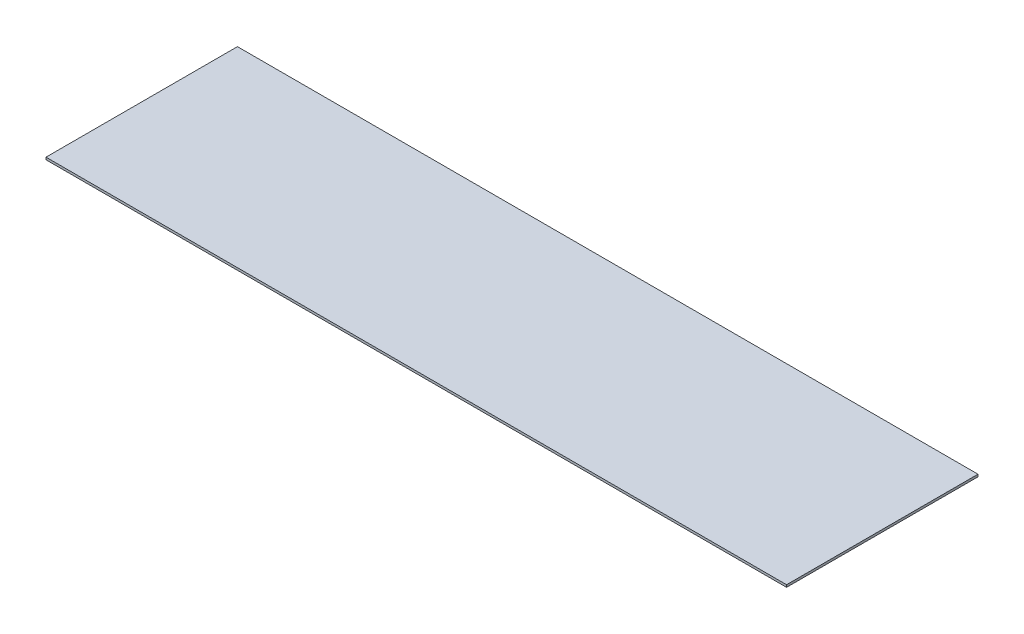
ISO-10303-21;
HEADER;
FILE_DESCRIPTION(('STEP AP214'),'2;1');
FILE_NAME('part.step','',(''),(''),'','','');
FILE_SCHEMA(('AUTOMOTIVE_DESIGN { 1 0 10303 214 1 1 1 1 }'));
ENDSEC;
DATA;
#1=APPLICATION_CONTEXT('core data for automotive mechanical design processes');
#2=APPLICATION_PROTOCOL_DEFINITION('international standard','automotive_design',2000,#1);
#3=PRODUCT_CONTEXT('',#1,'mechanical');
#4=PRODUCT('Part','Part','',(#3));
#5=PRODUCT_RELATED_PRODUCT_CATEGORY('part','',(#4));
#6=PRODUCT_DEFINITION_FORMATION('','',#4);
#7=PRODUCT_DEFINITION_CONTEXT('part definition',#1,'design');
#8=PRODUCT_DEFINITION('design','',#6,#7);
#9=PRODUCT_DEFINITION_SHAPE('','',#8);
#10=(LENGTH_UNIT() NAMED_UNIT(*) SI_UNIT(.MILLI.,.METRE.));
#11=(NAMED_UNIT(*) PLANE_ANGLE_UNIT() SI_UNIT($,.RADIAN.));
#12=(NAMED_UNIT(*) SI_UNIT($,.STERADIAN.) SOLID_ANGLE_UNIT());
#13=UNCERTAINTY_MEASURE_WITH_UNIT(LENGTH_MEASURE(1.E-05),#10,'distance_accuracy_value','');
#14=(GEOMETRIC_REPRESENTATION_CONTEXT(3) GLOBAL_UNCERTAINTY_ASSIGNED_CONTEXT((#13)) GLOBAL_UNIT_ASSIGNED_CONTEXT((#10,
#11,#12)) REPRESENTATION_CONTEXT('',''));
#15=CARTESIAN_POINT('',(0.,0.,0.));
#16=DIRECTION('',(0.,0.,1.));
#17=DIRECTION('',(1.,0.,0.));
#18=AXIS2_PLACEMENT_3D('',#15,#16,#17);
#19=CARTESIAN_POINT('',(510.9718,-10.8202226530762,112.934782157653));
#20=DIRECTION('',(0.,0.,-1.));
#21=DIRECTION('',(-1.,0.,0.));
#22=AXIS2_PLACEMENT_3D('',#19,#20,#21);
#23=PLANE('',#22);
#24=DIRECTION('',(0.,-1.,0.));
#25=VECTOR('',#24,1.);
#26=CARTESIAN_POINT('',(0.,-10.8202226530762,112.934782157653));
#27=LINE('',#26,#25);
#28=CARTESIAN_POINT('',(0.,-10.8202226530762,112.934782157653));
#29=VERTEX_POINT('',#28);
#30=CARTESIAN_POINT('',(0.,-12.4077226530762,112.934782157653));
#31=VERTEX_POINT('',#30);
#32=EDGE_CURVE('E102',#29,#31,#27,.T.);
#33=ORIENTED_EDGE('',*,*,#32,.T.);
#34=DIRECTION('',(-1.,0.,0.));
#35=VECTOR('',#34,1.);
#36=CARTESIAN_POINT('',(510.9718,-12.4077226530762,112.934782157653));
#37=LINE('',#36,#35);
#38=CARTESIAN_POINT('',(510.9718,-12.4077226530762,112.934782157653));
#39=VERTEX_POINT('',#38);
#40=EDGE_CURVE('E11',#39,#31,#37,.T.);
#41=ORIENTED_EDGE('',*,*,#40,.F.);
#42=DIRECTION('',(0.,-1.,0.));
#43=VECTOR('',#42,1.);
#44=CARTESIAN_POINT('',(510.9718,-10.8202226530762,112.934782157653));
#45=LINE('',#44,#43);
#46=CARTESIAN_POINT('',(510.9718,-10.8202226530762,112.934782157653));
#47=VERTEX_POINT('',#46);
#48=EDGE_CURVE('E90',#47,#39,#45,.T.);
#49=ORIENTED_EDGE('',*,*,#48,.F.);
#50=DIRECTION('',(-1.,0.,0.));
#51=VECTOR('',#50,1.);
#52=CARTESIAN_POINT('',(510.9718,-10.8202226530762,112.934782157653));
#53=LINE('',#52,#51);
#54=EDGE_CURVE('E98',#47,#29,#53,.T.);
#55=ORIENTED_EDGE('',*,*,#54,.T.);
#56=EDGE_LOOP('',(#33,#41,#49,#55));
#57=FACE_BOUND('',#56,.T.);
#58=ADVANCED_FACE('F39',(#57),#23,.F.);
#59=CARTESIAN_POINT('',(510.9718,-12.4077226530762,112.934782157653));
#60=DIRECTION('',(0.,1.,0.));
#61=DIRECTION('',(0.,0.,1.));
#62=AXIS2_PLACEMENT_3D('',#59,#60,#61);
#63=PLANE('',#62);
#64=DIRECTION('',(0.,0.,-1.));
#65=VECTOR('',#64,1.);
#66=CARTESIAN_POINT('',(0.,-12.4077226530762,112.934782157653));
#67=LINE('',#66,#65);
#68=CARTESIAN_POINT('',(0.,-12.4077226530762,-19.1452178423468));
#69=VERTEX_POINT('',#68);
#70=EDGE_CURVE('E94',#31,#69,#67,.T.);
#71=ORIENTED_EDGE('',*,*,#70,.T.);
#72=DIRECTION('',(-1.,0.,0.));
#73=VECTOR('',#72,1.);
#74=CARTESIAN_POINT('',(510.9718,-12.4077226530762,-19.1452178423468));
#75=LINE('',#74,#73);
#76=CARTESIAN_POINT('',(510.9718,-12.4077226530762,-19.1452178423468));
#77=VERTEX_POINT('',#76);
#78=EDGE_CURVE('E47',#77,#69,#75,.T.);
#79=ORIENTED_EDGE('',*,*,#78,.F.);
#80=DIRECTION('',(0.,0.,-1.));
#81=VECTOR('',#80,1.);
#82=CARTESIAN_POINT('',(510.9718,-12.4077226530762,112.934782157653));
#83=LINE('',#82,#81);
#84=EDGE_CURVE('E85',#39,#77,#83,.T.);
#85=ORIENTED_EDGE('',*,*,#84,.F.);
#86=ORIENTED_EDGE('',*,*,#40,.T.);
#87=EDGE_LOOP('',(#71,#79,#85,#86));
#88=FACE_BOUND('',#87,.T.);
#89=ADVANCED_FACE('F93',(#88),#63,.F.);
#90=CARTESIAN_POINT('',(510.9718,-10.8202226530762,-19.1452178423468));
#91=DIRECTION('',(0.,0.,1.));
#92=DIRECTION('',(0.,-1.,0.));
#93=AXIS2_PLACEMENT_3D('',#90,#91,#92);
#94=PLANE('',#93);
#95=DIRECTION('',(0.,1.,0.));
#96=VECTOR('',#95,1.);
#97=CARTESIAN_POINT('',(0.,-10.8202226530762,-19.1452178423468));
#98=LINE('',#97,#96);
#99=CARTESIAN_POINT('',(0.,-10.8202226530762,-19.1452178423468));
#100=VERTEX_POINT('',#99);
#101=EDGE_CURVE('E72',#69,#100,#98,.T.);
#102=ORIENTED_EDGE('',*,*,#101,.T.);
#103=DIRECTION('',(-1.,0.,0.));
#104=VECTOR('',#103,1.);
#105=CARTESIAN_POINT('',(510.9718,-10.8202226530762,-19.1452178423468));
#106=LINE('',#105,#104);
#107=CARTESIAN_POINT('',(510.9718,-10.8202226530762,-19.1452178423468));
#108=VERTEX_POINT('',#107);
#109=EDGE_CURVE('E95',#108,#100,#106,.T.);
#110=ORIENTED_EDGE('',*,*,#109,.F.);
#111=DIRECTION('',(0.,1.,0.));
#112=VECTOR('',#111,1.);
#113=CARTESIAN_POINT('',(510.9718,-10.8202226530762,-19.1452178423468));
#114=LINE('',#113,#112);
#115=EDGE_CURVE('E88',#77,#108,#114,.T.);
#116=ORIENTED_EDGE('',*,*,#115,.F.);
#117=ORIENTED_EDGE('',*,*,#78,.T.);
#118=EDGE_LOOP('',(#102,#110,#116,#117));
#119=FACE_BOUND('',#118,.T.);
#120=ADVANCED_FACE('F96',(#119),#94,.F.);
#121=CARTESIAN_POINT('',(510.9718,-10.8202226530762,112.934782157653));
#122=DIRECTION('',(0.,-1.,0.));
#123=DIRECTION('',(0.,0.,-1.));
#124=AXIS2_PLACEMENT_3D('',#121,#122,#123);
#125=PLANE('',#124);
#126=DIRECTION('',(0.,0.,1.));
#127=VECTOR('',#126,1.);
#128=CARTESIAN_POINT('',(0.,-10.8202226530762,112.934782157653));
#129=LINE('',#128,#127);
#130=EDGE_CURVE('E78',#100,#29,#129,.T.);
#131=ORIENTED_EDGE('',*,*,#130,.T.);
#132=ORIENTED_EDGE('',*,*,#54,.F.);
#133=DIRECTION('',(0.,0.,1.));
#134=VECTOR('',#133,1.);
#135=CARTESIAN_POINT('',(510.9718,-10.8202226530762,112.934782157653));
#136=LINE('',#135,#134);
#137=EDGE_CURVE('E55',#108,#47,#136,.T.);
#138=ORIENTED_EDGE('',*,*,#137,.F.);
#139=ORIENTED_EDGE('',*,*,#109,.T.);
#140=EDGE_LOOP('',(#131,#132,#138,#139));
#141=FACE_BOUND('',#140,.T.);
#142=ADVANCED_FACE('F109',(#141),#125,.F.);
#143=CARTESIAN_POINT('',(510.9718,0.,0.));
#144=DIRECTION('',(1.,0.,0.));
#145=DIRECTION('',(0.,0.,-1.));
#146=AXIS2_PLACEMENT_3D('',#143,#144,#145);
#147=PLANE('',#146);
#148=ORIENTED_EDGE('',*,*,#48,.T.);
#149=ORIENTED_EDGE('',*,*,#84,.T.);
#150=ORIENTED_EDGE('',*,*,#115,.T.);
#151=ORIENTED_EDGE('',*,*,#137,.T.);
#152=EDGE_LOOP('',(#148,#149,#150,#151));
#153=FACE_BOUND('',#152,.T.);
#154=ADVANCED_FACE('F86',(#153),#147,.T.);
#155=CARTESIAN_POINT('',(0.,0.,0.));
#156=DIRECTION('',(1.,0.,0.));
#157=DIRECTION('',(0.,0.,-1.));
#158=AXIS2_PLACEMENT_3D('',#155,#156,#157);
#159=PLANE('',#158);
#160=ORIENTED_EDGE('',*,*,#32,.F.);
#161=ORIENTED_EDGE('',*,*,#130,.F.);
#162=ORIENTED_EDGE('',*,*,#101,.F.);
#163=ORIENTED_EDGE('',*,*,#70,.F.);
#164=EDGE_LOOP('',(#160,#161,#162,#163));
#165=FACE_BOUND('',#164,.T.);
#166=ADVANCED_FACE('F112',(#165),#159,.F.);
#167=CLOSED_SHELL('',(#58,#89,#120,#142,#154,#166));
#168=MANIFOLD_SOLID_BREP('B2',#167);
#169=ADVANCED_BREP_SHAPE_REPRESENTATION('',(#18,#168),#14);
#170=SHAPE_DEFINITION_REPRESENTATION(#9,#169);
ENDSEC;
END-ISO-10303-21;
